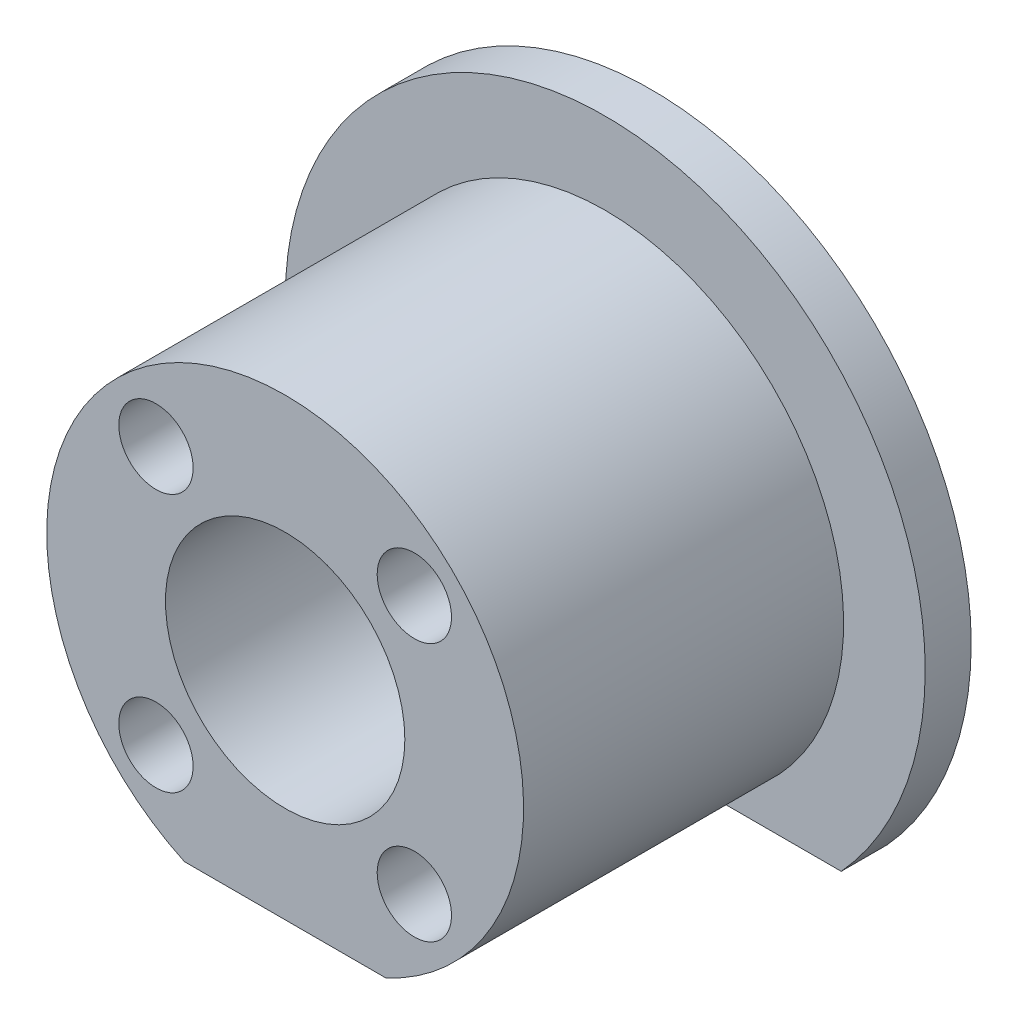
ISO-10303-21;
HEADER;
FILE_DESCRIPTION(('STEP AP214'),'2;1');
FILE_NAME('part.step','',(''),(''),'','','');
FILE_SCHEMA(('AUTOMOTIVE_DESIGN { 1 0 10303 214 1 1 1 1 }'));
ENDSEC;
DATA;
#1=APPLICATION_CONTEXT('core data for automotive mechanical design processes');
#2=APPLICATION_PROTOCOL_DEFINITION('international standard','automotive_design',2000,#1);
#3=PRODUCT_CONTEXT('',#1,'mechanical');
#4=PRODUCT('Part','Part','',(#3));
#5=PRODUCT_RELATED_PRODUCT_CATEGORY('part','',(#4));
#6=PRODUCT_DEFINITION_FORMATION('','',#4);
#7=PRODUCT_DEFINITION_CONTEXT('part definition',#1,'design');
#8=PRODUCT_DEFINITION('design','',#6,#7);
#9=PRODUCT_DEFINITION_SHAPE('','',#8);
#10=(LENGTH_UNIT() NAMED_UNIT(*) SI_UNIT(.MILLI.,.METRE.));
#11=(NAMED_UNIT(*) PLANE_ANGLE_UNIT() SI_UNIT($,.RADIAN.));
#12=(NAMED_UNIT(*) SI_UNIT($,.STERADIAN.) SOLID_ANGLE_UNIT());
#13=UNCERTAINTY_MEASURE_WITH_UNIT(LENGTH_MEASURE(1.E-05),#10,'distance_accuracy_value','');
#14=(GEOMETRIC_REPRESENTATION_CONTEXT(3) GLOBAL_UNCERTAINTY_ASSIGNED_CONTEXT((#13)) GLOBAL_UNIT_ASSIGNED_CONTEXT((#10,
#11,#12)) REPRESENTATION_CONTEXT('',''));
#15=CARTESIAN_POINT('',(0.,0.,0.));
#16=DIRECTION('',(0.,0.,1.));
#17=DIRECTION('',(1.,0.,0.));
#18=AXIS2_PLACEMENT_3D('',#15,#16,#17);
#19=CARTESIAN_POINT('',(0.,0.,14.524999906));
#20=DIRECTION('',(0.,0.,-1.));
#21=DIRECTION('',(-1.,0.,0.));
#22=AXIS2_PLACEMENT_3D('',#19,#20,#21);
#23=CYLINDRICAL_SURFACE('',#22,9.4615);
#24=CARTESIAN_POINT('',(0.,0.,1.824999906));
#25=DIRECTION('',(0.,0.,-1.));
#26=DIRECTION('',(-1.,0.,0.));
#27=AXIS2_PLACEMENT_3D('',#24,#25,#26);
#28=CIRCLE('',#27,9.4615);
#29=CARTESIAN_POINT('',(3.99860268345964,-8.57503112704726,1.824999906));
#30=VERTEX_POINT('',#29);
#31=CARTESIAN_POINT('',(-3.99860268345964,-8.57503112704726,1.824999906));
#32=VERTEX_POINT('',#31);
#33=EDGE_CURVE('E101',#30,#32,#28,.F.);
#34=ORIENTED_EDGE('',*,*,#33,.T.);
#35=DIRECTION('',(0.,0.,-1.));
#36=VECTOR('',#35,1.);
#37=CARTESIAN_POINT('',(-3.99860268345964,-8.57503112704726,14.524999906));
#38=LINE('',#37,#36);
#39=CARTESIAN_POINT('',(-3.99860268345964,-8.57503112704726,14.524999906));
#40=VERTEX_POINT('',#39);
#41=EDGE_CURVE('E12',#40,#32,#38,.T.);
#42=ORIENTED_EDGE('',*,*,#41,.F.);
#43=CARTESIAN_POINT('',(0.,0.,14.524999906));
#44=DIRECTION('',(0.,0.,1.));
#45=DIRECTION('',(-1.,0.,0.));
#46=AXIS2_PLACEMENT_3D('',#43,#44,#45);
#47=CIRCLE('',#46,9.4615);
#48=CARTESIAN_POINT('',(3.99860268345964,-8.57503112704726,14.524999906));
#49=VERTEX_POINT('',#48);
#50=EDGE_CURVE('E87',#49,#40,#47,.T.);
#51=ORIENTED_EDGE('',*,*,#50,.F.);
#52=DIRECTION('',(0.,0.,-1.));
#53=VECTOR('',#52,1.);
#54=CARTESIAN_POINT('',(3.99860268345964,-8.57503112704726,14.524999906));
#55=LINE('',#54,#53);
#56=EDGE_CURVE('E46',#49,#30,#55,.T.);
#57=ORIENTED_EDGE('',*,*,#56,.T.);
#58=EDGE_LOOP('',(#34,#42,#51,#57));
#59=FACE_BOUND('',#58,.T.);
#60=ADVANCED_FACE('F39',(#59),#23,.T.);
#61=CARTESIAN_POINT('',(0.,0.,14.524999906));
#62=DIRECTION('',(0.,0.,-1.));
#63=DIRECTION('',(-1.,0.,0.));
#64=AXIS2_PLACEMENT_3D('',#61,#62,#63);
#65=PLANE('',#64);
#66=CARTESIAN_POINT('',(-5.12652414804611,5.12652414804613,14.524999906));
#67=DIRECTION('',(0.,0.,-1.));
#68=DIRECTION('',(-1.,0.,0.));
#69=AXIS2_PLACEMENT_3D('',#66,#67,#68);
#70=CIRCLE('',#69,1.474999971);
#71=CARTESIAN_POINT('',(-6.60152411904611,5.12652414804613,14.524999906));
#72=VERTEX_POINT('',#71);
#73=EDGE_CURVE('E126',#72,#72,#70,.T.);
#74=ORIENTED_EDGE('',*,*,#73,.T.);
#75=EDGE_LOOP('',(#74));
#76=FACE_BOUND('',#75,.T.);
#77=CARTESIAN_POINT('',(5.12652414804613,5.12652414804611,14.524999906));
#78=DIRECTION('',(0.,0.,-1.));
#79=DIRECTION('',(-1.,0.,0.));
#80=AXIS2_PLACEMENT_3D('',#77,#78,#79);
#81=CIRCLE('',#80,1.474999971);
#82=CARTESIAN_POINT('',(3.65152417704613,5.12652414804611,14.524999906));
#83=VERTEX_POINT('',#82);
#84=EDGE_CURVE('E123',#83,#83,#81,.T.);
#85=ORIENTED_EDGE('',*,*,#84,.T.);
#86=EDGE_LOOP('',(#85));
#87=FACE_BOUND('',#86,.T.);
#88=CARTESIAN_POINT('',(5.12652414804611,-5.12652414804613,14.524999906));
#89=DIRECTION('',(0.,0.,-1.));
#90=DIRECTION('',(-1.,0.,0.));
#91=AXIS2_PLACEMENT_3D('',#88,#89,#90);
#92=CIRCLE('',#91,1.474999971);
#93=CARTESIAN_POINT('',(3.65152417704611,-5.12652414804613,14.524999906));
#94=VERTEX_POINT('',#93);
#95=EDGE_CURVE('E120',#94,#94,#92,.T.);
#96=ORIENTED_EDGE('',*,*,#95,.T.);
#97=EDGE_LOOP('',(#96));
#98=FACE_BOUND('',#97,.T.);
#99=CARTESIAN_POINT('',(-5.12652414804613,-5.12652414804611,14.524999906));
#100=DIRECTION('',(0.,0.,-1.));
#101=DIRECTION('',(-1.,0.,0.));
#102=AXIS2_PLACEMENT_3D('',#99,#100,#101);
#103=CIRCLE('',#102,1.474999971);
#104=CARTESIAN_POINT('',(-6.60152411904613,-5.12652414804611,14.524999906));
#105=VERTEX_POINT('',#104);
#106=EDGE_CURVE('E117',#105,#105,#103,.T.);
#107=ORIENTED_EDGE('',*,*,#106,.T.);
#108=EDGE_LOOP('',(#107));
#109=FACE_BOUND('',#108,.T.);
#110=ORIENTED_EDGE('',*,*,#50,.T.);
#111=DIRECTION('',(1.,0.,0.));
#112=VECTOR('',#111,1.);
#113=CARTESIAN_POINT('',(-3.99860268345964,-8.57503112704726,14.524999906));
#114=LINE('',#113,#112);
#115=EDGE_CURVE('E52',#40,#49,#114,.T.);
#116=ORIENTED_EDGE('',*,*,#115,.T.);
#117=EDGE_LOOP('',(#110,#116));
#118=FACE_BOUND('',#117,.T.);
#119=CARTESIAN_POINT('',(0.,0.,14.524999906));
#120=DIRECTION('',(0.,0.,1.));
#121=DIRECTION('',(1.,0.,0.));
#122=AXIS2_PLACEMENT_3D('',#119,#120,#121);
#123=CIRCLE('',#122,4.750000025);
#124=CARTESIAN_POINT('',(4.750000025,0.,14.524999906));
#125=VERTEX_POINT('',#124);
#126=EDGE_CURVE('E88',#125,#125,#123,.T.);
#127=ORIENTED_EDGE('',*,*,#126,.F.);
#128=EDGE_LOOP('',(#127));
#129=FACE_BOUND('',#128,.T.);
#130=ADVANCED_FACE('F152',(#76,#87,#98,#109,#118,#129),#65,.F.);
#131=CARTESIAN_POINT('',(0.,0.,0.));
#132=DIRECTION('',(0.,0.,-1.));
#133=DIRECTION('',(-1.,0.,0.));
#134=AXIS2_PLACEMENT_3D('',#131,#132,#133);
#135=PLANE('',#134);
#136=CARTESIAN_POINT('',(-5.12652414804611,5.12652414804613,0.));
#137=DIRECTION('',(0.,0.,-1.));
#138=DIRECTION('',(-1.,0.,0.));
#139=AXIS2_PLACEMENT_3D('',#136,#137,#138);
#140=CIRCLE('',#139,1.474999971);
#141=CARTESIAN_POINT('',(-6.60152411904611,5.12652414804613,0.));
#142=VERTEX_POINT('',#141);
#143=EDGE_CURVE('E112',#142,#142,#140,.T.);
#144=ORIENTED_EDGE('',*,*,#143,.F.);
#145=EDGE_LOOP('',(#144));
#146=FACE_BOUND('',#145,.T.);
#147=CARTESIAN_POINT('',(5.12652414804613,5.12652414804611,0.));
#148=DIRECTION('',(0.,0.,-1.));
#149=DIRECTION('',(-1.,0.,0.));
#150=AXIS2_PLACEMENT_3D('',#147,#148,#149);
#151=CIRCLE('',#150,1.474999971);
#152=CARTESIAN_POINT('',(3.65152417704613,5.12652414804611,0.));
#153=VERTEX_POINT('',#152);
#154=EDGE_CURVE('E109',#153,#153,#151,.T.);
#155=ORIENTED_EDGE('',*,*,#154,.F.);
#156=EDGE_LOOP('',(#155));
#157=FACE_BOUND('',#156,.T.);
#158=CARTESIAN_POINT('',(5.12652414804611,-5.12652414804613,0.));
#159=DIRECTION('',(0.,0.,-1.));
#160=DIRECTION('',(-1.,0.,0.));
#161=AXIS2_PLACEMENT_3D('',#158,#159,#160);
#162=CIRCLE('',#161,1.474999971);
#163=CARTESIAN_POINT('',(3.65152417704611,-5.12652414804613,0.));
#164=VERTEX_POINT('',#163);
#165=EDGE_CURVE('E105',#164,#164,#162,.T.);
#166=ORIENTED_EDGE('',*,*,#165,.F.);
#167=EDGE_LOOP('',(#166));
#168=FACE_BOUND('',#167,.T.);
#169=CARTESIAN_POINT('',(-5.12652414804613,-5.12652414804611,0.));
#170=DIRECTION('',(0.,0.,-1.));
#171=DIRECTION('',(-1.,0.,0.));
#172=AXIS2_PLACEMENT_3D('',#169,#170,#171);
#173=CIRCLE('',#172,1.474999971);
#174=CARTESIAN_POINT('',(-6.60152411904613,-5.12652414804611,0.));
#175=VERTEX_POINT('',#174);
#176=EDGE_CURVE('E108',#175,#175,#173,.T.);
#177=ORIENTED_EDGE('',*,*,#176,.F.);
#178=EDGE_LOOP('',(#177));
#179=FACE_BOUND('',#178,.T.);
#180=DIRECTION('',(1.,0.,0.));
#181=VECTOR('',#180,1.);
#182=CARTESIAN_POINT('',(-3.99860268345964,-8.57503112704726,0.));
#183=LINE('',#182,#181);
#184=CARTESIAN_POINT('',(-9.36796889246386,-8.57503112704726,0.));
#185=VERTEX_POINT('',#184);
#186=CARTESIAN_POINT('',(9.36796889246386,-8.57503112704726,0.));
#187=VERTEX_POINT('',#186);
#188=EDGE_CURVE('E75',#185,#187,#183,.T.);
#189=ORIENTED_EDGE('',*,*,#188,.F.);
#190=CARTESIAN_POINT('',(0.,0.,0.));
#191=DIRECTION('',(0.,0.,1.));
#192=DIRECTION('',(-1.,0.,0.));
#193=AXIS2_PLACEMENT_3D('',#190,#191,#192);
#194=CIRCLE('',#193,12.7);
#195=EDGE_CURVE('E92',#187,#185,#194,.T.);
#196=ORIENTED_EDGE('',*,*,#195,.F.);
#197=EDGE_LOOP('',(#189,#196));
#198=FACE_BOUND('',#197,.T.);
#199=CARTESIAN_POINT('',(0.,0.,0.));
#200=DIRECTION('',(0.,0.,1.));
#201=DIRECTION('',(1.,0.,0.));
#202=AXIS2_PLACEMENT_3D('',#199,#200,#201);
#203=CIRCLE('',#202,4.750000025);
#204=CARTESIAN_POINT('',(4.750000025,0.,0.));
#205=VERTEX_POINT('',#204);
#206=EDGE_CURVE('E129',#205,#205,#203,.T.);
#207=ORIENTED_EDGE('',*,*,#206,.T.);
#208=EDGE_LOOP('',(#207));
#209=FACE_BOUND('',#208,.T.);
#210=ADVANCED_FACE('F96',(#146,#157,#168,#179,#198,#209),#135,.T.);
#211=CARTESIAN_POINT('',(-3.99860268345964,-8.57503112704726,14.524999906));
#212=DIRECTION('',(0.,1.,0.));
#213=DIRECTION('',(-1.,0.,0.));
#214=AXIS2_PLACEMENT_3D('',#211,#212,#213);
#215=PLANE('',#214);
#216=ORIENTED_EDGE('',*,*,#188,.T.);
#217=DIRECTION('',(0.,0.,-1.));
#218=VECTOR('',#217,1.);
#219=CARTESIAN_POINT('',(9.36796889246386,-8.57503112704726,47.6578680199564));
#220=LINE('',#219,#218);
#221=CARTESIAN_POINT('',(9.36796889246386,-8.57503112704726,1.824999906));
#222=VERTEX_POINT('',#221);
#223=EDGE_CURVE('E79',#222,#187,#220,.T.);
#224=ORIENTED_EDGE('',*,*,#223,.F.);
#225=DIRECTION('',(-1.,0.,0.));
#226=VECTOR('',#225,1.);
#227=CARTESIAN_POINT('',(3.99860268345964,-8.57503112704726,1.824999906));
#228=LINE('',#227,#226);
#229=EDGE_CURVE('E140',#222,#30,#228,.T.);
#230=ORIENTED_EDGE('',*,*,#229,.T.);
#231=ORIENTED_EDGE('',*,*,#56,.F.);
#232=ORIENTED_EDGE('',*,*,#115,.F.);
#233=ORIENTED_EDGE('',*,*,#41,.T.);
#234=DIRECTION('',(-1.,0.,0.));
#235=VECTOR('',#234,1.);
#236=CARTESIAN_POINT('',(-3.99860268345964,-8.57503112704726,1.824999906));
#237=LINE('',#236,#235);
#238=CARTESIAN_POINT('',(-9.36796889246386,-8.57503112704726,1.824999906));
#239=VERTEX_POINT('',#238);
#240=EDGE_CURVE('E94',#32,#239,#237,.T.);
#241=ORIENTED_EDGE('',*,*,#240,.T.);
#242=DIRECTION('',(0.,0.,-1.));
#243=VECTOR('',#242,1.);
#244=CARTESIAN_POINT('',(-9.36796889246386,-8.57503112704726,47.6578680199564));
#245=LINE('',#244,#243);
#246=EDGE_CURVE('E83',#239,#185,#245,.T.);
#247=ORIENTED_EDGE('',*,*,#246,.T.);
#248=EDGE_LOOP('',(#216,#224,#230,#231,#232,#233,#241,#247));
#249=FACE_BOUND('',#248,.T.);
#250=ADVANCED_FACE('F77',(#249),#215,.F.);
#251=CARTESIAN_POINT('',(0.,0.,14.524999906));
#252=DIRECTION('',(0.,0.,-1.));
#253=DIRECTION('',(-1.,0.,0.));
#254=AXIS2_PLACEMENT_3D('',#251,#252,#253);
#255=CYLINDRICAL_SURFACE('',#254,4.750000025);
#256=ORIENTED_EDGE('',*,*,#126,.T.);
#257=EDGE_LOOP('',(#256));
#258=FACE_BOUND('',#257,.T.);
#259=ORIENTED_EDGE('',*,*,#206,.F.);
#260=EDGE_LOOP('',(#259));
#261=FACE_BOUND('',#260,.T.);
#262=ADVANCED_FACE('F165',(#258,#261),#255,.F.);
#263=CARTESIAN_POINT('',(-5.12652414804613,-5.12652414804611,19.05));
#264=DIRECTION('',(0.,0.,-1.));
#265=DIRECTION('',(-1.,0.,0.));
#266=AXIS2_PLACEMENT_3D('',#263,#264,#265);
#267=CYLINDRICAL_SURFACE('',#266,1.474999971);
#268=ORIENTED_EDGE('',*,*,#176,.T.);
#269=EDGE_LOOP('',(#268));
#270=FACE_BOUND('',#269,.T.);
#271=ORIENTED_EDGE('',*,*,#106,.F.);
#272=EDGE_LOOP('',(#271));
#273=FACE_BOUND('',#272,.T.);
#274=ADVANCED_FACE('F171',(#270,#273),#267,.F.);
#275=CARTESIAN_POINT('',(5.12652414804611,-5.12652414804613,19.05));
#276=DIRECTION('',(0.,0.,-1.));
#277=DIRECTION('',(-1.,0.,0.));
#278=AXIS2_PLACEMENT_3D('',#275,#276,#277);
#279=CYLINDRICAL_SURFACE('',#278,1.474999971);
#280=ORIENTED_EDGE('',*,*,#165,.T.);
#281=EDGE_LOOP('',(#280));
#282=FACE_BOUND('',#281,.T.);
#283=ORIENTED_EDGE('',*,*,#95,.F.);
#284=EDGE_LOOP('',(#283));
#285=FACE_BOUND('',#284,.T.);
#286=ADVANCED_FACE('F176',(#282,#285),#279,.F.);
#287=CARTESIAN_POINT('',(5.12652414804613,5.12652414804611,19.05));
#288=DIRECTION('',(0.,0.,-1.));
#289=DIRECTION('',(-1.,0.,0.));
#290=AXIS2_PLACEMENT_3D('',#287,#288,#289);
#291=CYLINDRICAL_SURFACE('',#290,1.474999971);
#292=ORIENTED_EDGE('',*,*,#154,.T.);
#293=EDGE_LOOP('',(#292));
#294=FACE_BOUND('',#293,.T.);
#295=ORIENTED_EDGE('',*,*,#84,.F.);
#296=EDGE_LOOP('',(#295));
#297=FACE_BOUND('',#296,.T.);
#298=ADVANCED_FACE('F185',(#294,#297),#291,.F.);
#299=CARTESIAN_POINT('',(-5.12652414804611,5.12652414804613,19.05));
#300=DIRECTION('',(0.,0.,-1.));
#301=DIRECTION('',(-1.,0.,0.));
#302=AXIS2_PLACEMENT_3D('',#299,#300,#301);
#303=CYLINDRICAL_SURFACE('',#302,1.474999971);
#304=ORIENTED_EDGE('',*,*,#143,.T.);
#305=EDGE_LOOP('',(#304));
#306=FACE_BOUND('',#305,.T.);
#307=ORIENTED_EDGE('',*,*,#73,.F.);
#308=EDGE_LOOP('',(#307));
#309=FACE_BOUND('',#308,.T.);
#310=ADVANCED_FACE('F149',(#306,#309),#303,.F.);
#311=CARTESIAN_POINT('',(0.,0.,47.6578680199564));
#312=DIRECTION('',(0.,0.,-1.));
#313=DIRECTION('',(-1.,0.,0.));
#314=AXIS2_PLACEMENT_3D('',#311,#312,#313);
#315=CYLINDRICAL_SURFACE('',#314,12.7);
#316=ORIENTED_EDGE('',*,*,#246,.F.);
#317=CARTESIAN_POINT('',(0.,0.,1.824999906));
#318=DIRECTION('',(0.,0.,-1.));
#319=DIRECTION('',(-1.,0.,0.));
#320=AXIS2_PLACEMENT_3D('',#317,#318,#319);
#321=CIRCLE('',#320,12.7);
#322=EDGE_CURVE('E93',#239,#222,#321,.T.);
#323=ORIENTED_EDGE('',*,*,#322,.T.);
#324=ORIENTED_EDGE('',*,*,#223,.T.);
#325=ORIENTED_EDGE('',*,*,#195,.T.);
#326=EDGE_LOOP('',(#316,#323,#324,#325));
#327=FACE_BOUND('',#326,.T.);
#328=ADVANCED_FACE('F91',(#327),#315,.T.);
#329=CARTESIAN_POINT('',(0.,0.,1.824999906));
#330=DIRECTION('',(0.,0.,-1.));
#331=DIRECTION('',(-1.,0.,0.));
#332=AXIS2_PLACEMENT_3D('',#329,#330,#331);
#333=PLANE('',#332);
#334=ORIENTED_EDGE('',*,*,#229,.F.);
#335=ORIENTED_EDGE('',*,*,#322,.F.);
#336=ORIENTED_EDGE('',*,*,#240,.F.);
#337=ORIENTED_EDGE('',*,*,#33,.F.);
#338=EDGE_LOOP('',(#334,#335,#336,#337));
#339=FACE_BOUND('',#338,.T.);
#340=ADVANCED_FACE('F143',(#339),#333,.F.);
#341=CLOSED_SHELL('',(#60,#130,#210,#250,#262,#274,#286,#298,#310,#328,#340));
#342=MANIFOLD_SOLID_BREP('B2',#341);
#343=ADVANCED_BREP_SHAPE_REPRESENTATION('',(#18,#342),#14);
#344=SHAPE_DEFINITION_REPRESENTATION(#9,#343);
ENDSEC;
END-ISO-10303-21;
